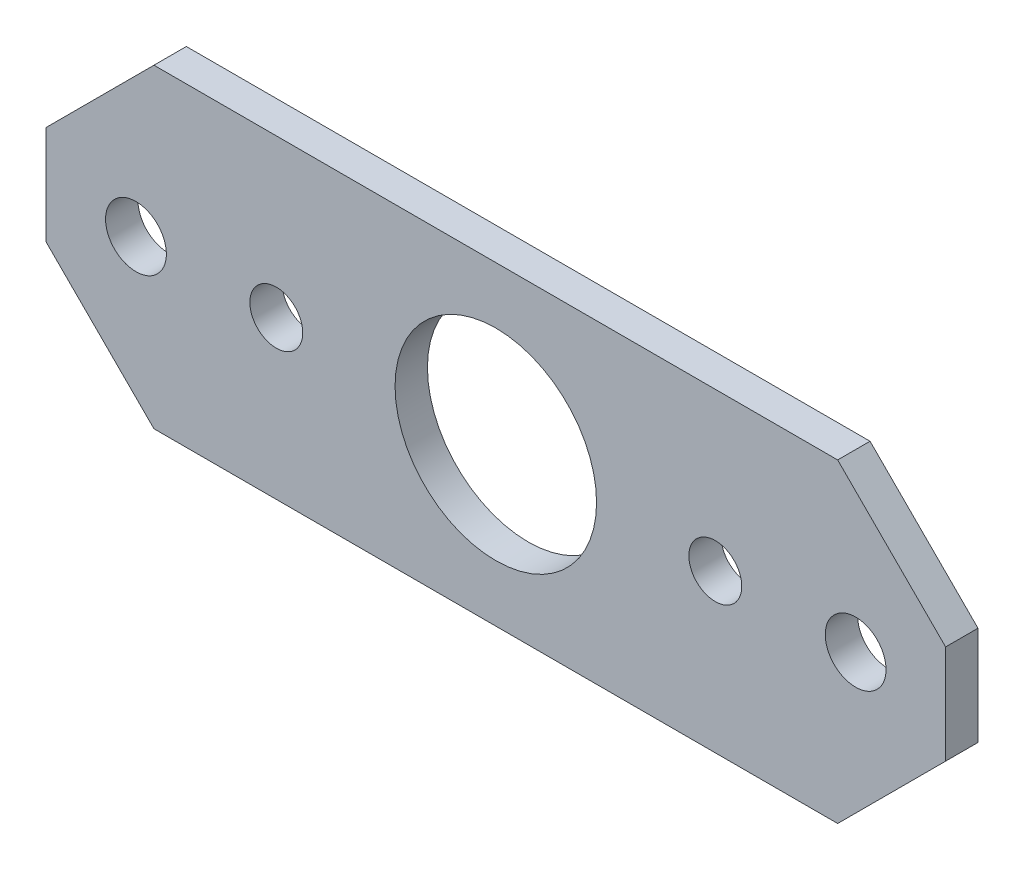
ISO-10303-21;
HEADER;
FILE_DESCRIPTION(('STEP AP214'),'2;1');
FILE_NAME('part.step','',(''),(''),'','','');
FILE_SCHEMA(('AUTOMOTIVE_DESIGN { 1 0 10303 214 1 1 1 1 }'));
ENDSEC;
DATA;
#1=APPLICATION_CONTEXT('core data for automotive mechanical design processes');
#2=APPLICATION_PROTOCOL_DEFINITION('international standard','automotive_design',2000,#1);
#3=PRODUCT_CONTEXT('',#1,'mechanical');
#4=PRODUCT('Part','Part','',(#3));
#5=PRODUCT_RELATED_PRODUCT_CATEGORY('part','',(#4));
#6=PRODUCT_DEFINITION_FORMATION('','',#4);
#7=PRODUCT_DEFINITION_CONTEXT('part definition',#1,'design');
#8=PRODUCT_DEFINITION('design','',#6,#7);
#9=PRODUCT_DEFINITION_SHAPE('','',#8);
#10=(LENGTH_UNIT() NAMED_UNIT(*) SI_UNIT(.MILLI.,.METRE.));
#11=(NAMED_UNIT(*) PLANE_ANGLE_UNIT() SI_UNIT($,.RADIAN.));
#12=(NAMED_UNIT(*) SI_UNIT($,.STERADIAN.) SOLID_ANGLE_UNIT());
#13=UNCERTAINTY_MEASURE_WITH_UNIT(LENGTH_MEASURE(1.E-05),#10,'distance_accuracy_value','');
#14=(GEOMETRIC_REPRESENTATION_CONTEXT(3) GLOBAL_UNCERTAINTY_ASSIGNED_CONTEXT((#13)) GLOBAL_UNIT_ASSIGNED_CONTEXT((#10,
#11,#12)) REPRESENTATION_CONTEXT('',''));
#15=CARTESIAN_POINT('',(0.,0.,0.));
#16=DIRECTION('',(0.,0.,1.));
#17=DIRECTION('',(1.,0.,0.));
#18=AXIS2_PLACEMENT_3D('',#15,#16,#17);
#19=CARTESIAN_POINT('',(-31.75,-11.1125,2.286));
#20=DIRECTION('',(0.,0.,1.));
#21=DIRECTION('',(1.,0.,0.));
#22=AXIS2_PLACEMENT_3D('',#19,#20,#21);
#23=PLANE('',#22);
#24=DIRECTION('',(1.,0.,0.));
#25=VECTOR('',#24,1.);
#26=CARTESIAN_POINT('',(-31.75,11.1125,2.286));
#27=LINE('',#26,#25);
#28=CARTESIAN_POINT('',(24.13,11.1125,2.286));
#29=VERTEX_POINT('',#28);
#30=CARTESIAN_POINT('',(-24.13,11.1125,2.286));
#31=VERTEX_POINT('',#30);
#32=EDGE_CURVE('E338',#29,#31,#27,.F.);
#33=ORIENTED_EDGE('',*,*,#32,.T.);
#34=DIRECTION('',(0.707106781186547,0.707106781186548,0.));
#35=VECTOR('',#34,1.);
#36=CARTESIAN_POINT('',(-31.75,3.4925,2.286));
#37=LINE('',#36,#35);
#38=CARTESIAN_POINT('',(-31.75,3.4925,2.286));
#39=VERTEX_POINT('',#38);
#40=EDGE_CURVE('E333',#31,#39,#37,.F.);
#41=ORIENTED_EDGE('',*,*,#40,.T.);
#42=DIRECTION('',(0.,1.,0.));
#43=VECTOR('',#42,1.);
#44=CARTESIAN_POINT('',(-31.75,11.1125,2.286));
#45=LINE('',#44,#43);
#46=CARTESIAN_POINT('',(-31.75,-3.4925,2.286));
#47=VERTEX_POINT('',#46);
#48=EDGE_CURVE('E328',#39,#47,#45,.F.);
#49=ORIENTED_EDGE('',*,*,#48,.T.);
#50=DIRECTION('',(-0.707106781186548,0.707106781186548,0.));
#51=VECTOR('',#50,1.);
#52=CARTESIAN_POINT('',(-24.13,-11.1125,2.286));
#53=LINE('',#52,#51);
#54=CARTESIAN_POINT('',(-24.13,-11.1125,2.286));
#55=VERTEX_POINT('',#54);
#56=EDGE_CURVE('E323',#47,#55,#53,.F.);
#57=ORIENTED_EDGE('',*,*,#56,.T.);
#58=DIRECTION('',(1.,0.,0.));
#59=VECTOR('',#58,1.);
#60=CARTESIAN_POINT('',(-31.75,-11.1125,2.286));
#61=LINE('',#60,#59);
#62=CARTESIAN_POINT('',(24.13,-11.1125,2.286));
#63=VERTEX_POINT('',#62);
#64=EDGE_CURVE('E84',#55,#63,#61,.T.);
#65=ORIENTED_EDGE('',*,*,#64,.T.);
#66=DIRECTION('',(-0.707106781186548,-0.707106781186547,0.));
#67=VECTOR('',#66,1.);
#68=CARTESIAN_POINT('',(31.75,-3.4925,2.286));
#69=LINE('',#68,#67);
#70=CARTESIAN_POINT('',(31.75,-3.4925,2.286));
#71=VERTEX_POINT('',#70);
#72=EDGE_CURVE('E82',#63,#71,#69,.F.);
#73=ORIENTED_EDGE('',*,*,#72,.T.);
#74=DIRECTION('',(0.,1.,0.));
#75=VECTOR('',#74,1.);
#76=CARTESIAN_POINT('',(31.75,11.1125,2.286));
#77=LINE('',#76,#75);
#78=CARTESIAN_POINT('',(31.75,3.4925,2.286));
#79=VERTEX_POINT('',#78);
#80=EDGE_CURVE('E79',#71,#79,#77,.T.);
#81=ORIENTED_EDGE('',*,*,#80,.T.);
#82=DIRECTION('',(0.707106781186548,-0.707106781186547,0.));
#83=VECTOR('',#82,1.);
#84=CARTESIAN_POINT('',(24.13,11.1125,2.286));
#85=LINE('',#84,#83);
#86=EDGE_CURVE('E308',#79,#29,#85,.F.);
#87=ORIENTED_EDGE('',*,*,#86,.T.);
#88=EDGE_LOOP('',(#33,#41,#49,#57,#65,#73,#81,#87));
#89=FACE_BOUND('',#88,.T.);
#90=CARTESIAN_POINT('',(0.,0.,2.286));
#91=DIRECTION('',(0.,0.,-1.));
#92=DIRECTION('',(-1.,0.,0.));
#93=AXIS2_PLACEMENT_3D('',#90,#91,#92);
#94=CIRCLE('',#93,7.112);
#95=CARTESIAN_POINT('',(-7.112,0.,2.286));
#96=VERTEX_POINT('',#95);
#97=EDGE_CURVE('E90',#96,#96,#94,.T.);
#98=ORIENTED_EDGE('',*,*,#97,.T.);
#99=EDGE_LOOP('',(#98));
#100=FACE_BOUND('',#99,.T.);
#101=CARTESIAN_POINT('',(25.4,0.,2.286));
#102=DIRECTION('',(0.,0.,-1.));
#103=DIRECTION('',(-1.,0.,0.));
#104=AXIS2_PLACEMENT_3D('',#101,#102,#103);
#105=CIRCLE('',#104,2.1463);
#106=CARTESIAN_POINT('',(23.2537,0.,2.286));
#107=VERTEX_POINT('',#106);
#108=EDGE_CURVE('E122',#107,#107,#105,.T.);
#109=ORIENTED_EDGE('',*,*,#108,.T.);
#110=EDGE_LOOP('',(#109));
#111=FACE_BOUND('',#110,.T.);
#112=CARTESIAN_POINT('',(-25.4,0.,2.286));
#113=DIRECTION('',(0.,0.,-1.));
#114=DIRECTION('',(-1.,0.,0.));
#115=AXIS2_PLACEMENT_3D('',#112,#113,#114);
#116=CIRCLE('',#115,2.1463);
#117=CARTESIAN_POINT('',(-27.5463,0.,2.286));
#118=VERTEX_POINT('',#117);
#119=EDGE_CURVE('E125',#118,#118,#116,.T.);
#120=ORIENTED_EDGE('',*,*,#119,.T.);
#121=EDGE_LOOP('',(#120));
#122=FACE_BOUND('',#121,.T.);
#123=CARTESIAN_POINT('',(15.494,0.,2.286));
#124=DIRECTION('',(0.,0.,-1.));
#125=DIRECTION('',(-1.,0.,0.));
#126=AXIS2_PLACEMENT_3D('',#123,#124,#125);
#127=CIRCLE('',#126,1.8669);
#128=CARTESIAN_POINT('',(13.6271,0.,2.286));
#129=VERTEX_POINT('',#128);
#130=EDGE_CURVE('E127',#129,#129,#127,.T.);
#131=ORIENTED_EDGE('',*,*,#130,.T.);
#132=EDGE_LOOP('',(#131));
#133=FACE_BOUND('',#132,.T.);
#134=CARTESIAN_POINT('',(-15.494,0.,2.286));
#135=DIRECTION('',(0.,0.,-1.));
#136=DIRECTION('',(-1.,0.,0.));
#137=AXIS2_PLACEMENT_3D('',#134,#135,#136);
#138=CIRCLE('',#137,1.8669);
#139=CARTESIAN_POINT('',(-17.3609,0.,2.286));
#140=VERTEX_POINT('',#139);
#141=EDGE_CURVE('E20',#140,#140,#138,.T.);
#142=ORIENTED_EDGE('',*,*,#141,.T.);
#143=EDGE_LOOP('',(#142));
#144=FACE_BOUND('',#143,.T.);
#145=ADVANCED_FACE('F17',(#89,#100,#111,#122,#133,#144),#23,.T.);
#146=CARTESIAN_POINT('',(-15.494,0.,2.286));
#147=DIRECTION('',(0.,0.,-1.));
#148=DIRECTION('',(-1.,0.,0.));
#149=AXIS2_PLACEMENT_3D('',#146,#147,#148);
#150=CYLINDRICAL_SURFACE('',#149,1.8669);
#151=ORIENTED_EDGE('',*,*,#141,.F.);
#152=EDGE_LOOP('',(#151));
#153=FACE_BOUND('',#152,.T.);
#154=CARTESIAN_POINT('',(-15.494,0.,0.));
#155=DIRECTION('',(0.,0.,-1.));
#156=DIRECTION('',(-1.,0.,0.));
#157=AXIS2_PLACEMENT_3D('',#154,#155,#156);
#158=CIRCLE('',#157,1.8669);
#159=CARTESIAN_POINT('',(-17.3609,0.,0.));
#160=VERTEX_POINT('',#159);
#161=EDGE_CURVE('E117',#160,#160,#158,.T.);
#162=ORIENTED_EDGE('',*,*,#161,.T.);
#163=EDGE_LOOP('',(#162));
#164=FACE_BOUND('',#163,.T.);
#165=ADVANCED_FACE('F135',(#153,#164),#150,.F.);
#166=CARTESIAN_POINT('',(15.494,0.,2.286));
#167=DIRECTION('',(0.,0.,-1.));
#168=DIRECTION('',(-1.,0.,0.));
#169=AXIS2_PLACEMENT_3D('',#166,#167,#168);
#170=CYLINDRICAL_SURFACE('',#169,1.8669);
#171=ORIENTED_EDGE('',*,*,#130,.F.);
#172=EDGE_LOOP('',(#171));
#173=FACE_BOUND('',#172,.T.);
#174=CARTESIAN_POINT('',(15.494,0.,0.));
#175=DIRECTION('',(0.,0.,-1.));
#176=DIRECTION('',(-1.,0.,0.));
#177=AXIS2_PLACEMENT_3D('',#174,#175,#176);
#178=CIRCLE('',#177,1.8669);
#179=CARTESIAN_POINT('',(13.6271,0.,0.));
#180=VERTEX_POINT('',#179);
#181=EDGE_CURVE('E114',#180,#180,#178,.T.);
#182=ORIENTED_EDGE('',*,*,#181,.T.);
#183=EDGE_LOOP('',(#182));
#184=FACE_BOUND('',#183,.T.);
#185=ADVANCED_FACE('F138',(#173,#184),#170,.F.);
#186=CARTESIAN_POINT('',(-25.4,0.,2.286));
#187=DIRECTION('',(0.,0.,-1.));
#188=DIRECTION('',(-1.,0.,0.));
#189=AXIS2_PLACEMENT_3D('',#186,#187,#188);
#190=CYLINDRICAL_SURFACE('',#189,2.1463);
#191=ORIENTED_EDGE('',*,*,#119,.F.);
#192=EDGE_LOOP('',(#191));
#193=FACE_BOUND('',#192,.T.);
#194=CARTESIAN_POINT('',(-25.4,0.,0.));
#195=DIRECTION('',(0.,0.,-1.));
#196=DIRECTION('',(-1.,0.,0.));
#197=AXIS2_PLACEMENT_3D('',#194,#195,#196);
#198=CIRCLE('',#197,2.1463);
#199=CARTESIAN_POINT('',(-27.5463,0.,0.));
#200=VERTEX_POINT('',#199);
#201=EDGE_CURVE('E111',#200,#200,#198,.T.);
#202=ORIENTED_EDGE('',*,*,#201,.T.);
#203=EDGE_LOOP('',(#202));
#204=FACE_BOUND('',#203,.T.);
#205=ADVANCED_FACE('F185',(#193,#204),#190,.F.);
#206=CARTESIAN_POINT('',(25.4,0.,2.286));
#207=DIRECTION('',(0.,0.,-1.));
#208=DIRECTION('',(-1.,0.,0.));
#209=AXIS2_PLACEMENT_3D('',#206,#207,#208);
#210=CYLINDRICAL_SURFACE('',#209,2.1463);
#211=ORIENTED_EDGE('',*,*,#108,.F.);
#212=EDGE_LOOP('',(#211));
#213=FACE_BOUND('',#212,.T.);
#214=CARTESIAN_POINT('',(25.4,0.,0.));
#215=DIRECTION('',(0.,0.,-1.));
#216=DIRECTION('',(-1.,0.,0.));
#217=AXIS2_PLACEMENT_3D('',#214,#215,#216);
#218=CIRCLE('',#217,2.1463);
#219=CARTESIAN_POINT('',(23.2537,0.,0.));
#220=VERTEX_POINT('',#219);
#221=EDGE_CURVE('E108',#220,#220,#218,.T.);
#222=ORIENTED_EDGE('',*,*,#221,.T.);
#223=EDGE_LOOP('',(#222));
#224=FACE_BOUND('',#223,.T.);
#225=ADVANCED_FACE('F181',(#213,#224),#210,.F.);
#226=CARTESIAN_POINT('',(0.,0.,2.286));
#227=DIRECTION('',(0.,0.,-1.));
#228=DIRECTION('',(-1.,0.,0.));
#229=AXIS2_PLACEMENT_3D('',#226,#227,#228);
#230=CYLINDRICAL_SURFACE('',#229,7.112);
#231=ORIENTED_EDGE('',*,*,#97,.F.);
#232=EDGE_LOOP('',(#231));
#233=FACE_BOUND('',#232,.T.);
#234=CARTESIAN_POINT('',(0.,0.,0.));
#235=DIRECTION('',(0.,0.,-1.));
#236=DIRECTION('',(-1.,0.,0.));
#237=AXIS2_PLACEMENT_3D('',#234,#235,#236);
#238=CIRCLE('',#237,7.112);
#239=CARTESIAN_POINT('',(-7.112,0.,0.));
#240=VERTEX_POINT('',#239);
#241=EDGE_CURVE('E105',#240,#240,#238,.T.);
#242=ORIENTED_EDGE('',*,*,#241,.T.);
#243=EDGE_LOOP('',(#242));
#244=FACE_BOUND('',#243,.T.);
#245=ADVANCED_FACE('F178',(#233,#244),#230,.F.);
#246=CARTESIAN_POINT('',(31.75,-3.4925,2.286));
#247=DIRECTION('',(-0.707106781186547,0.707106781186548,0.));
#248=DIRECTION('',(-0.707106781186548,-0.707106781186547,0.));
#249=AXIS2_PLACEMENT_3D('',#246,#247,#248);
#250=PLANE('',#249);
#251=DIRECTION('',(0.,0.,1.));
#252=VECTOR('',#251,1.);
#253=CARTESIAN_POINT('',(24.13,-11.1125,2.286));
#254=LINE('',#253,#252);
#255=CARTESIAN_POINT('',(24.13,-11.1125,0.));
#256=VERTEX_POINT('',#255);
#257=EDGE_CURVE('E321',#63,#256,#254,.F.);
#258=ORIENTED_EDGE('',*,*,#257,.T.);
#259=DIRECTION('',(0.707106781186548,0.707106781186547,0.));
#260=VECTOR('',#259,1.);
#261=CARTESIAN_POINT('',(24.13,-11.1125,0.));
#262=LINE('',#261,#260);
#263=CARTESIAN_POINT('',(31.75,-3.4925,0.));
#264=VERTEX_POINT('',#263);
#265=EDGE_CURVE('E101',#256,#264,#262,.T.);
#266=ORIENTED_EDGE('',*,*,#265,.T.);
#267=DIRECTION('',(0.,0.,1.));
#268=VECTOR('',#267,1.);
#269=CARTESIAN_POINT('',(31.75,-3.4925,2.286));
#270=LINE('',#269,#268);
#271=EDGE_CURVE('E89',#264,#71,#270,.T.);
#272=ORIENTED_EDGE('',*,*,#271,.T.);
#273=ORIENTED_EDGE('',*,*,#72,.F.);
#274=EDGE_LOOP('',(#258,#266,#272,#273));
#275=FACE_BOUND('',#274,.T.);
#276=ADVANCED_FACE('F100',(#275),#250,.F.);
#277=CARTESIAN_POINT('',(31.75,11.1125,2.286));
#278=DIRECTION('',(-1.,0.,0.));
#279=DIRECTION('',(0.,0.,1.));
#280=AXIS2_PLACEMENT_3D('',#277,#278,#279);
#281=PLANE('',#280);
#282=ORIENTED_EDGE('',*,*,#271,.F.);
#283=DIRECTION('',(0.,1.,0.));
#284=VECTOR('',#283,1.);
#285=CARTESIAN_POINT('',(31.75,-11.1125,0.));
#286=LINE('',#285,#284);
#287=CARTESIAN_POINT('',(31.75,3.4925,0.));
#288=VERTEX_POINT('',#287);
#289=EDGE_CURVE('E310',#264,#288,#286,.T.);
#290=ORIENTED_EDGE('',*,*,#289,.T.);
#291=DIRECTION('',(0.,0.,1.));
#292=VECTOR('',#291,1.);
#293=CARTESIAN_POINT('',(31.75,3.4925,2.286));
#294=LINE('',#293,#292);
#295=EDGE_CURVE('E97',#288,#79,#294,.T.);
#296=ORIENTED_EDGE('',*,*,#295,.T.);
#297=ORIENTED_EDGE('',*,*,#80,.F.);
#298=EDGE_LOOP('',(#282,#290,#296,#297));
#299=FACE_BOUND('',#298,.T.);
#300=ADVANCED_FACE('F94',(#299),#281,.F.);
#301=CARTESIAN_POINT('',(24.13,11.1125,2.286));
#302=DIRECTION('',(-0.707106781186547,-0.707106781186548,0.));
#303=DIRECTION('',(0.707106781186548,-0.707106781186547,0.));
#304=AXIS2_PLACEMENT_3D('',#301,#302,#303);
#305=PLANE('',#304);
#306=ORIENTED_EDGE('',*,*,#295,.F.);
#307=DIRECTION('',(-0.707106781186548,0.707106781186547,0.));
#308=VECTOR('',#307,1.);
#309=CARTESIAN_POINT('',(31.75,3.4925,0.));
#310=LINE('',#309,#308);
#311=CARTESIAN_POINT('',(24.13,11.1125,0.));
#312=VERTEX_POINT('',#311);
#313=EDGE_CURVE('E307',#288,#312,#310,.T.);
#314=ORIENTED_EDGE('',*,*,#313,.T.);
#315=DIRECTION('',(0.,0.,-1.));
#316=VECTOR('',#315,1.);
#317=CARTESIAN_POINT('',(24.13,11.1125,2.286));
#318=LINE('',#317,#316);
#319=EDGE_CURVE('E340',#312,#29,#318,.F.);
#320=ORIENTED_EDGE('',*,*,#319,.T.);
#321=ORIENTED_EDGE('',*,*,#86,.F.);
#322=EDGE_LOOP('',(#306,#314,#320,#321));
#323=FACE_BOUND('',#322,.T.);
#324=ADVANCED_FACE('F169',(#323),#305,.F.);
#325=CARTESIAN_POINT('',(-31.75,11.1125,2.286));
#326=DIRECTION('',(0.,-1.,0.));
#327=DIRECTION('',(0.,0.,-1.));
#328=AXIS2_PLACEMENT_3D('',#325,#326,#327);
#329=PLANE('',#328);
#330=ORIENTED_EDGE('',*,*,#319,.F.);
#331=DIRECTION('',(1.,0.,0.));
#332=VECTOR('',#331,1.);
#333=CARTESIAN_POINT('',(-31.75,11.1125,0.));
#334=LINE('',#333,#332);
#335=CARTESIAN_POINT('',(-24.13,11.1125,0.));
#336=VERTEX_POINT('',#335);
#337=EDGE_CURVE('E313',#312,#336,#334,.F.);
#338=ORIENTED_EDGE('',*,*,#337,.T.);
#339=DIRECTION('',(0.,0.,1.));
#340=VECTOR('',#339,1.);
#341=CARTESIAN_POINT('',(-24.13,11.1125,2.286));
#342=LINE('',#341,#340);
#343=EDGE_CURVE('E335',#336,#31,#342,.T.);
#344=ORIENTED_EDGE('',*,*,#343,.T.);
#345=ORIENTED_EDGE('',*,*,#32,.F.);
#346=EDGE_LOOP('',(#330,#338,#344,#345));
#347=FACE_BOUND('',#346,.T.);
#348=ADVANCED_FACE('F165',(#347),#329,.F.);
#349=CARTESIAN_POINT('',(-31.75,3.4925,2.286));
#350=DIRECTION('',(0.707106781186548,-0.707106781186547,0.));
#351=DIRECTION('',(0.707106781186547,0.707106781186548,0.));
#352=AXIS2_PLACEMENT_3D('',#349,#350,#351);
#353=PLANE('',#352);
#354=ORIENTED_EDGE('',*,*,#343,.F.);
#355=DIRECTION('',(-0.707106781186547,-0.707106781186548,0.));
#356=VECTOR('',#355,1.);
#357=CARTESIAN_POINT('',(-24.13,11.1125,0.));
#358=LINE('',#357,#356);
#359=CARTESIAN_POINT('',(-31.75,3.4925,0.));
#360=VERTEX_POINT('',#359);
#361=EDGE_CURVE('E345',#336,#360,#358,.T.);
#362=ORIENTED_EDGE('',*,*,#361,.T.);
#363=DIRECTION('',(0.,0.,-1.));
#364=VECTOR('',#363,1.);
#365=CARTESIAN_POINT('',(-31.75,3.4925,2.286));
#366=LINE('',#365,#364);
#367=EDGE_CURVE('E330',#360,#39,#366,.F.);
#368=ORIENTED_EDGE('',*,*,#367,.T.);
#369=ORIENTED_EDGE('',*,*,#40,.F.);
#370=EDGE_LOOP('',(#354,#362,#368,#369));
#371=FACE_BOUND('',#370,.T.);
#372=ADVANCED_FACE('F161',(#371),#353,.F.);
#373=CARTESIAN_POINT('',(-31.75,11.1125,2.286));
#374=DIRECTION('',(1.,0.,0.));
#375=DIRECTION('',(0.,0.,-1.));
#376=AXIS2_PLACEMENT_3D('',#373,#374,#375);
#377=PLANE('',#376);
#378=DIRECTION('',(0.,0.,1.));
#379=VECTOR('',#378,1.);
#380=CARTESIAN_POINT('',(-31.75,-3.4925,2.286));
#381=LINE('',#380,#379);
#382=CARTESIAN_POINT('',(-31.75,-3.4925,0.));
#383=VERTEX_POINT('',#382);
#384=EDGE_CURVE('E325',#383,#47,#381,.T.);
#385=ORIENTED_EDGE('',*,*,#384,.T.);
#386=ORIENTED_EDGE('',*,*,#48,.F.);
#387=ORIENTED_EDGE('',*,*,#367,.F.);
#388=DIRECTION('',(0.,1.,0.));
#389=VECTOR('',#388,1.);
#390=CARTESIAN_POINT('',(-31.75,-11.1125,0.));
#391=LINE('',#390,#389);
#392=EDGE_CURVE('E348',#360,#383,#391,.F.);
#393=ORIENTED_EDGE('',*,*,#392,.T.);
#394=EDGE_LOOP('',(#385,#386,#387,#393));
#395=FACE_BOUND('',#394,.T.);
#396=ADVANCED_FACE('F157',(#395),#377,.F.);
#397=CARTESIAN_POINT('',(-24.13,-11.1125,2.286));
#398=DIRECTION('',(0.707106781186548,0.707106781186548,0.));
#399=DIRECTION('',(-0.707106781186548,0.707106781186548,0.));
#400=AXIS2_PLACEMENT_3D('',#397,#398,#399);
#401=PLANE('',#400);
#402=ORIENTED_EDGE('',*,*,#384,.F.);
#403=DIRECTION('',(0.707106781186547,-0.707106781186548,0.));
#404=VECTOR('',#403,1.);
#405=CARTESIAN_POINT('',(-31.75,-3.4925,0.));
#406=LINE('',#405,#404);
#407=CARTESIAN_POINT('',(-24.13,-11.1125,0.));
#408=VERTEX_POINT('',#407);
#409=EDGE_CURVE('E26',#383,#408,#406,.T.);
#410=ORIENTED_EDGE('',*,*,#409,.T.);
#411=DIRECTION('',(0.,0.,1.));
#412=VECTOR('',#411,1.);
#413=CARTESIAN_POINT('',(-24.13,-11.1125,2.286));
#414=LINE('',#413,#412);
#415=EDGE_CURVE('E34',#408,#55,#414,.T.);
#416=ORIENTED_EDGE('',*,*,#415,.T.);
#417=ORIENTED_EDGE('',*,*,#56,.F.);
#418=EDGE_LOOP('',(#402,#410,#416,#417));
#419=FACE_BOUND('',#418,.T.);
#420=ADVANCED_FACE('F150',(#419),#401,.F.);
#421=CARTESIAN_POINT('',(-31.75,-11.1125,2.286));
#422=DIRECTION('',(0.,1.,0.));
#423=DIRECTION('',(0.,0.,1.));
#424=AXIS2_PLACEMENT_3D('',#421,#422,#423);
#425=PLANE('',#424);
#426=ORIENTED_EDGE('',*,*,#415,.F.);
#427=DIRECTION('',(1.,0.,0.));
#428=VECTOR('',#427,1.);
#429=CARTESIAN_POINT('',(-31.75,-11.1125,0.));
#430=LINE('',#429,#428);
#431=EDGE_CURVE('E11',#408,#256,#430,.T.);
#432=ORIENTED_EDGE('',*,*,#431,.T.);
#433=ORIENTED_EDGE('',*,*,#257,.F.);
#434=ORIENTED_EDGE('',*,*,#64,.F.);
#435=EDGE_LOOP('',(#426,#432,#433,#434));
#436=FACE_BOUND('',#435,.T.);
#437=ADVANCED_FACE('F143',(#436),#425,.F.);
#438=CARTESIAN_POINT('',(-31.75,-11.1125,0.));
#439=DIRECTION('',(0.,0.,1.));
#440=DIRECTION('',(1.,0.,0.));
#441=AXIS2_PLACEMENT_3D('',#438,#439,#440);
#442=PLANE('',#441);
#443=ORIENTED_EDGE('',*,*,#409,.F.);
#444=ORIENTED_EDGE('',*,*,#392,.F.);
#445=ORIENTED_EDGE('',*,*,#361,.F.);
#446=ORIENTED_EDGE('',*,*,#337,.F.);
#447=ORIENTED_EDGE('',*,*,#313,.F.);
#448=ORIENTED_EDGE('',*,*,#289,.F.);
#449=ORIENTED_EDGE('',*,*,#265,.F.);
#450=ORIENTED_EDGE('',*,*,#431,.F.);
#451=EDGE_LOOP('',(#443,#444,#445,#446,#447,#448,#449,#450));
#452=FACE_BOUND('',#451,.T.);
#453=ORIENTED_EDGE('',*,*,#241,.F.);
#454=EDGE_LOOP('',(#453));
#455=FACE_BOUND('',#454,.T.);
#456=ORIENTED_EDGE('',*,*,#221,.F.);
#457=EDGE_LOOP('',(#456));
#458=FACE_BOUND('',#457,.T.);
#459=ORIENTED_EDGE('',*,*,#201,.F.);
#460=EDGE_LOOP('',(#459));
#461=FACE_BOUND('',#460,.T.);
#462=ORIENTED_EDGE('',*,*,#181,.F.);
#463=EDGE_LOOP('',(#462));
#464=FACE_BOUND('',#463,.T.);
#465=ORIENTED_EDGE('',*,*,#161,.F.);
#466=EDGE_LOOP('',(#465));
#467=FACE_BOUND('',#466,.T.);
#468=ADVANCED_FACE('F141',(#452,#455,#458,#461,#464,#467),#442,.F.);
#469=CLOSED_SHELL('',(#145,#165,#185,#205,#225,#245,#276,#300,#324,#348,#372,#396,#420,#437,#468));
#470=MANIFOLD_SOLID_BREP('B1',#469);
#471=ADVANCED_BREP_SHAPE_REPRESENTATION('',(#18,#470),#14);
#472=SHAPE_DEFINITION_REPRESENTATION(#9,#471);
ENDSEC;
END-ISO-10303-21;
